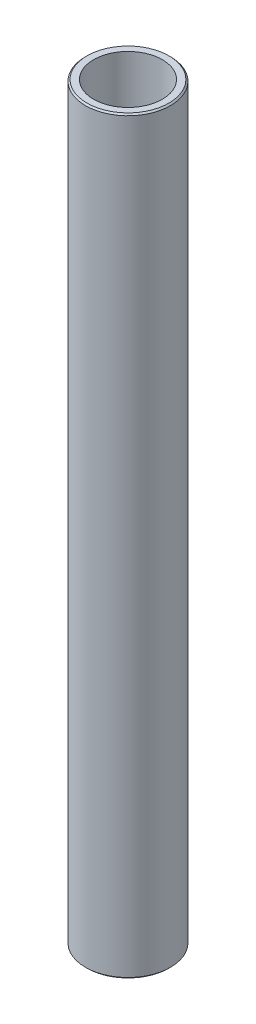
ISO-10303-21;
HEADER;
FILE_DESCRIPTION(('STEP AP214'),'2;1');
FILE_NAME('part.step','',(''),(''),'','','');
FILE_SCHEMA(('AUTOMOTIVE_DESIGN { 1 0 10303 214 1 1 1 1 }'));
ENDSEC;
DATA;
#1=APPLICATION_CONTEXT('core data for automotive mechanical design processes');
#2=APPLICATION_PROTOCOL_DEFINITION('international standard','automotive_design',2000,#1);
#3=PRODUCT_CONTEXT('',#1,'mechanical');
#4=PRODUCT('Part','Part','',(#3));
#5=PRODUCT_RELATED_PRODUCT_CATEGORY('part','',(#4));
#6=PRODUCT_DEFINITION_FORMATION('','',#4);
#7=PRODUCT_DEFINITION_CONTEXT('part definition',#1,'design');
#8=PRODUCT_DEFINITION('design','',#6,#7);
#9=PRODUCT_DEFINITION_SHAPE('','',#8);
#10=(LENGTH_UNIT() NAMED_UNIT(*) SI_UNIT(.MILLI.,.METRE.));
#11=(NAMED_UNIT(*) PLANE_ANGLE_UNIT() SI_UNIT($,.RADIAN.));
#12=(NAMED_UNIT(*) SI_UNIT($,.STERADIAN.) SOLID_ANGLE_UNIT());
#13=UNCERTAINTY_MEASURE_WITH_UNIT(LENGTH_MEASURE(1.E-05),#10,'distance_accuracy_value','');
#14=(GEOMETRIC_REPRESENTATION_CONTEXT(3) GLOBAL_UNCERTAINTY_ASSIGNED_CONTEXT((#13)) GLOBAL_UNIT_ASSIGNED_CONTEXT((#10,
#11,#12)) REPRESENTATION_CONTEXT('',''));
#15=CARTESIAN_POINT('',(0.,0.,0.));
#16=DIRECTION('',(0.,0.,1.));
#17=DIRECTION('',(1.,0.,0.));
#18=AXIS2_PLACEMENT_3D('',#15,#16,#17);
#19=CARTESIAN_POINT('',(0.,353.067346771259,0.));
#20=DIRECTION('',(0.,-1.,0.));
#21=DIRECTION('',(0.,0.,-1.));
#22=AXIS2_PLACEMENT_3D('',#19,#20,#21);
#23=CYLINDRICAL_SURFACE('',#22,20.);
#24=CARTESIAN_POINT('',(0.,352.376741741117,0.));
#25=DIRECTION('',(0.,1.,0.));
#26=DIRECTION('',(0.,0.,1.));
#27=AXIS2_PLACEMENT_3D('',#24,#25,#26);
#28=CIRCLE('',#27,20.);
#29=CARTESIAN_POINT('',(0.,352.376741741117,20.));
#30=VERTEX_POINT('',#29);
#31=EDGE_CURVE('E50',#30,#30,#28,.F.);
#32=ORIENTED_EDGE('',*,*,#31,.T.);
#33=EDGE_LOOP('',(#32));
#34=FACE_BOUND('',#33,.T.);
#35=CARTESIAN_POINT('',(0.,0.690605030142788,0.));
#36=DIRECTION('',(0.,1.,0.));
#37=DIRECTION('',(0.,0.,1.));
#38=AXIS2_PLACEMENT_3D('',#35,#36,#37);
#39=CIRCLE('',#38,20.);
#40=CARTESIAN_POINT('',(0.,0.690605030142788,20.));
#41=VERTEX_POINT('',#40);
#42=EDGE_CURVE('E51',#41,#41,#39,.T.);
#43=ORIENTED_EDGE('',*,*,#42,.T.);
#44=EDGE_LOOP('',(#43));
#45=FACE_BOUND('',#44,.T.);
#46=ADVANCED_FACE('F39',(#34,#45),#23,.T.);
#47=CARTESIAN_POINT('',(0.,353.067346771259,0.));
#48=DIRECTION('',(0.,1.,0.));
#49=DIRECTION('',(0.,0.,1.));
#50=AXIS2_PLACEMENT_3D('',#47,#48,#49);
#51=PLANE('',#50);
#52=CARTESIAN_POINT('',(0.,353.067346771259,0.));
#53=DIRECTION('',(0.,1.,0.));
#54=DIRECTION('',(0.,0.,1.));
#55=AXIS2_PLACEMENT_3D('',#52,#53,#54);
#56=CIRCLE('',#55,19.3093949698572);
#57=CARTESIAN_POINT('',(0.,353.067346771259,19.3093949698572));
#58=VERTEX_POINT('',#57);
#59=EDGE_CURVE('E54',#58,#58,#56,.T.);
#60=ORIENTED_EDGE('',*,*,#59,.T.);
#61=EDGE_LOOP('',(#60));
#62=FACE_BOUND('',#61,.T.);
#63=CARTESIAN_POINT('',(0.,353.067346771259,0.));
#64=DIRECTION('',(0.,1.,0.));
#65=DIRECTION('',(0.,0.,1.));
#66=AXIS2_PLACEMENT_3D('',#63,#64,#65);
#67=CIRCLE('',#66,16.1932345074019);
#68=CARTESIAN_POINT('',(0.,353.067346771259,16.1932345074019));
#69=VERTEX_POINT('',#68);
#70=EDGE_CURVE('E58',#69,#69,#67,.T.);
#71=ORIENTED_EDGE('',*,*,#70,.F.);
#72=EDGE_LOOP('',(#71));
#73=FACE_BOUND('',#72,.T.);
#74=ADVANCED_FACE('F69',(#62,#73),#51,.T.);
#75=CARTESIAN_POINT('',(0.,0.,0.));
#76=DIRECTION('',(0.,1.,0.));
#77=DIRECTION('',(0.,0.,1.));
#78=AXIS2_PLACEMENT_3D('',#75,#76,#77);
#79=PLANE('',#78);
#80=CARTESIAN_POINT('',(0.,0.,0.));
#81=DIRECTION('',(0.,1.,0.));
#82=DIRECTION('',(0.,0.,1.));
#83=AXIS2_PLACEMENT_3D('',#80,#81,#82);
#84=CIRCLE('',#83,19.3093949698572);
#85=CARTESIAN_POINT('',(0.,0.,19.3093949698572));
#86=VERTEX_POINT('',#85);
#87=EDGE_CURVE('E10',#86,#86,#84,.F.);
#88=ORIENTED_EDGE('',*,*,#87,.T.);
#89=EDGE_LOOP('',(#88));
#90=FACE_BOUND('',#89,.T.);
#91=CARTESIAN_POINT('',(0.,0.,0.));
#92=DIRECTION('',(0.,1.,0.));
#93=DIRECTION('',(0.,0.,1.));
#94=AXIS2_PLACEMENT_3D('',#91,#92,#93);
#95=CIRCLE('',#94,16.1932345074019);
#96=CARTESIAN_POINT('',(0.,0.,16.1932345074019));
#97=VERTEX_POINT('',#96);
#98=EDGE_CURVE('E63',#97,#97,#95,.T.);
#99=ORIENTED_EDGE('',*,*,#98,.T.);
#100=EDGE_LOOP('',(#99));
#101=FACE_BOUND('',#100,.T.);
#102=ADVANCED_FACE('F75',(#90,#101),#79,.F.);
#103=CARTESIAN_POINT('',(0.,353.067346771259,0.));
#104=DIRECTION('',(0.,-1.,0.));
#105=DIRECTION('',(0.,0.,-1.));
#106=AXIS2_PLACEMENT_3D('',#103,#104,#105);
#107=CYLINDRICAL_SURFACE('',#106,16.1932345074019);
#108=ORIENTED_EDGE('',*,*,#70,.T.);
#109=EDGE_LOOP('',(#108));
#110=FACE_BOUND('',#109,.T.);
#111=ORIENTED_EDGE('',*,*,#98,.F.);
#112=EDGE_LOOP('',(#111));
#113=FACE_BOUND('',#112,.T.);
#114=ADVANCED_FACE('F70',(#110,#113),#107,.F.);
#115=CARTESIAN_POINT('',(0.,353.067346771259,0.));
#116=DIRECTION('',(0.,-1.,0.));
#117=DIRECTION('',(0.,0.,-1.));
#118=AXIS2_PLACEMENT_3D('',#115,#116,#117);
#119=CONICAL_SURFACE('',#118,19.3093949698572,0.785398163397476);
#120=ORIENTED_EDGE('',*,*,#31,.F.);
#121=EDGE_LOOP('',(#120));
#122=FACE_BOUND('',#121,.T.);
#123=ORIENTED_EDGE('',*,*,#59,.F.);
#124=EDGE_LOOP('',(#123));
#125=FACE_BOUND('',#124,.T.);
#126=ADVANCED_FACE('F81',(#122,#125),#119,.T.);
#127=CARTESIAN_POINT('',(0.,0.690605030142788,0.));
#128=DIRECTION('',(0.,1.,0.));
#129=DIRECTION('',(0.,0.,1.));
#130=AXIS2_PLACEMENT_3D('',#127,#128,#129);
#131=CONICAL_SURFACE('',#130,20.,0.785398163397476);
#132=ORIENTED_EDGE('',*,*,#87,.F.);
#133=EDGE_LOOP('',(#132));
#134=FACE_BOUND('',#133,.T.);
#135=ORIENTED_EDGE('',*,*,#42,.F.);
#136=EDGE_LOOP('',(#135));
#137=FACE_BOUND('',#136,.T.);
#138=ADVANCED_FACE('F45',(#134,#137),#131,.T.);
#139=CLOSED_SHELL('',(#46,#74,#102,#114,#126,#138));
#140=MANIFOLD_SOLID_BREP('B2',#139);
#141=ADVANCED_BREP_SHAPE_REPRESENTATION('',(#18,#140),#14);
#142=SHAPE_DEFINITION_REPRESENTATION(#9,#141);
ENDSEC;
END-ISO-10303-21;
